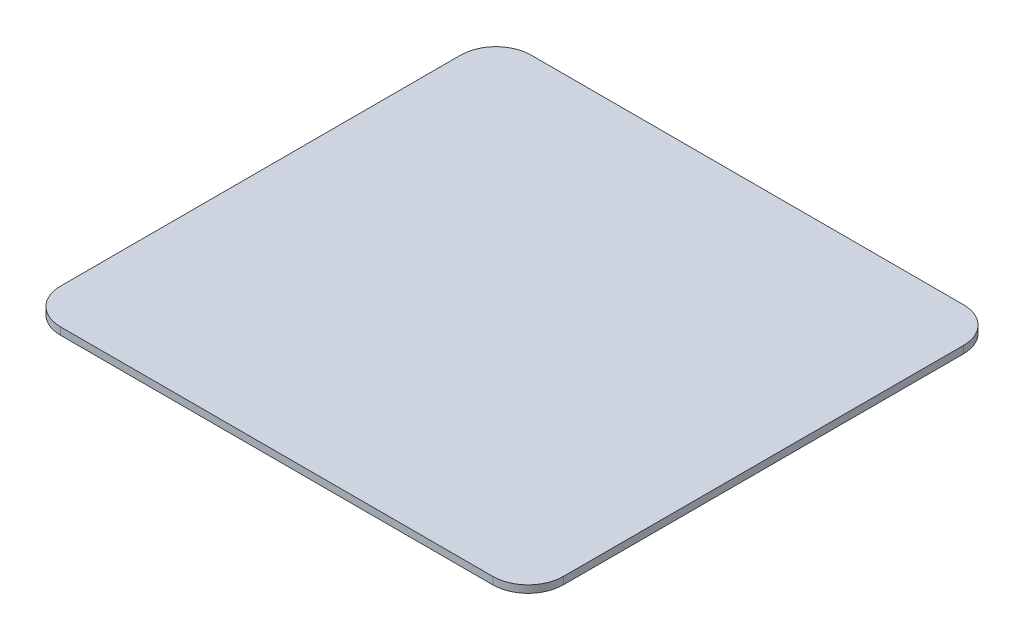
ISO-10303-21;
HEADER;
FILE_DESCRIPTION(('STEP AP214'),'2;1');
FILE_NAME('part.step','',(''),(''),'','','');
FILE_SCHEMA(('AUTOMOTIVE_DESIGN { 1 0 10303 214 1 1 1 1 }'));
ENDSEC;
DATA;
#1=APPLICATION_CONTEXT('core data for automotive mechanical design processes');
#2=APPLICATION_PROTOCOL_DEFINITION('international standard','automotive_design',2000,#1);
#3=PRODUCT_CONTEXT('',#1,'mechanical');
#4=PRODUCT('Part','Part','',(#3));
#5=PRODUCT_RELATED_PRODUCT_CATEGORY('part','',(#4));
#6=PRODUCT_DEFINITION_FORMATION('','',#4);
#7=PRODUCT_DEFINITION_CONTEXT('part definition',#1,'design');
#8=PRODUCT_DEFINITION('design','',#6,#7);
#9=PRODUCT_DEFINITION_SHAPE('','',#8);
#10=(LENGTH_UNIT() NAMED_UNIT(*) SI_UNIT(.MILLI.,.METRE.));
#11=(NAMED_UNIT(*) PLANE_ANGLE_UNIT() SI_UNIT($,.RADIAN.));
#12=(NAMED_UNIT(*) SI_UNIT($,.STERADIAN.) SOLID_ANGLE_UNIT());
#13=UNCERTAINTY_MEASURE_WITH_UNIT(LENGTH_MEASURE(1.E-05),#10,'distance_accuracy_value','');
#14=(GEOMETRIC_REPRESENTATION_CONTEXT(3) GLOBAL_UNCERTAINTY_ASSIGNED_CONTEXT((#13)) GLOBAL_UNIT_ASSIGNED_CONTEXT((#10,
#11,#12)) REPRESENTATION_CONTEXT('',''));
#15=CARTESIAN_POINT('',(0.,0.,0.));
#16=DIRECTION('',(0.,0.,1.));
#17=DIRECTION('',(1.,0.,0.));
#18=AXIS2_PLACEMENT_3D('',#15,#16,#17);
#19=CARTESIAN_POINT('',(0.,-1.5875,0.));
#20=DIRECTION('',(0.,1.,0.));
#21=DIRECTION('',(0.,0.,1.));
#22=AXIS2_PLACEMENT_3D('',#19,#20,#21);
#23=PLANE('',#22);
#24=DIRECTION('',(0.,0.,-1.));
#25=VECTOR('',#24,1.);
#26=CARTESIAN_POINT('',(-54.356,-1.5875,0.));
#27=LINE('',#26,#25);
#28=CARTESIAN_POINT('',(-54.356,-1.5875,43.2562));
#29=VERTEX_POINT('',#28);
#30=CARTESIAN_POINT('',(-54.356,-1.5875,-43.2562));
#31=VERTEX_POINT('',#30);
#32=EDGE_CURVE('E208',#29,#31,#27,.T.);
#33=ORIENTED_EDGE('',*,*,#32,.T.);
#34=CARTESIAN_POINT('',(-46.736,-1.5875,-43.2562));
#35=DIRECTION('',(0.,1.,0.));
#36=DIRECTION('',(0.,0.,1.));
#37=AXIS2_PLACEMENT_3D('',#34,#35,#36);
#38=CIRCLE('',#37,7.62);
#39=CARTESIAN_POINT('',(-46.736,-1.5875,-50.8762));
#40=VERTEX_POINT('',#39);
#41=EDGE_CURVE('E240',#31,#40,#38,.F.);
#42=ORIENTED_EDGE('',*,*,#41,.T.);
#43=DIRECTION('',(-1.,0.,0.));
#44=VECTOR('',#43,1.);
#45=CARTESIAN_POINT('',(0.,-1.5875,-50.8762));
#46=LINE('',#45,#44);
#47=CARTESIAN_POINT('',(46.736,-1.5875,-50.8762));
#48=VERTEX_POINT('',#47);
#49=EDGE_CURVE('E215',#48,#40,#46,.T.);
#50=ORIENTED_EDGE('',*,*,#49,.F.);
#51=CARTESIAN_POINT('',(46.736,-1.5875,-43.2562));
#52=DIRECTION('',(0.,1.,0.));
#53=DIRECTION('',(0.,0.,1.));
#54=AXIS2_PLACEMENT_3D('',#51,#52,#53);
#55=CIRCLE('',#54,7.62);
#56=CARTESIAN_POINT('',(54.356,-1.5875,-43.2562));
#57=VERTEX_POINT('',#56);
#58=EDGE_CURVE('E131',#48,#57,#55,.F.);
#59=ORIENTED_EDGE('',*,*,#58,.T.);
#60=DIRECTION('',(0.,0.,-1.));
#61=VECTOR('',#60,1.);
#62=CARTESIAN_POINT('',(54.356,-1.5875,0.));
#63=LINE('',#62,#61);
#64=CARTESIAN_POINT('',(54.356,-1.5875,43.2562));
#65=VERTEX_POINT('',#64);
#66=EDGE_CURVE('E263',#65,#57,#63,.T.);
#67=ORIENTED_EDGE('',*,*,#66,.F.);
#68=CARTESIAN_POINT('',(46.736,-1.5875,43.2562));
#69=DIRECTION('',(0.,1.,0.));
#70=DIRECTION('',(0.,0.,1.));
#71=AXIS2_PLACEMENT_3D('',#68,#69,#70);
#72=CIRCLE('',#71,7.62);
#73=CARTESIAN_POINT('',(46.736,-1.5875,50.8762));
#74=VERTEX_POINT('',#73);
#75=EDGE_CURVE('E235',#65,#74,#72,.F.);
#76=ORIENTED_EDGE('',*,*,#75,.T.);
#77=DIRECTION('',(-1.,0.,0.));
#78=VECTOR('',#77,1.);
#79=CARTESIAN_POINT('',(0.,-1.5875,50.8762));
#80=LINE('',#79,#78);
#81=CARTESIAN_POINT('',(-46.736,-1.5875,50.8762));
#82=VERTEX_POINT('',#81);
#83=EDGE_CURVE('E254',#74,#82,#80,.T.);
#84=ORIENTED_EDGE('',*,*,#83,.T.);
#85=CARTESIAN_POINT('',(-46.736,-1.5875,43.2562));
#86=DIRECTION('',(0.,1.,0.));
#87=DIRECTION('',(0.,0.,1.));
#88=AXIS2_PLACEMENT_3D('',#85,#86,#87);
#89=CIRCLE('',#88,7.62);
#90=EDGE_CURVE('E232',#82,#29,#89,.F.);
#91=ORIENTED_EDGE('',*,*,#90,.T.);
#92=EDGE_LOOP('',(#33,#42,#50,#59,#67,#76,#84,#91));
#93=FACE_BOUND('',#92,.T.);
#94=ADVANCED_FACE('F115',(#93),#23,.F.);
#95=CARTESIAN_POINT('',(0.,0.,0.));
#96=DIRECTION('',(0.,1.,0.));
#97=DIRECTION('',(0.,0.,1.));
#98=AXIS2_PLACEMENT_3D('',#95,#96,#97);
#99=PLANE('',#98);
#100=DIRECTION('',(-1.,0.,0.));
#101=VECTOR('',#100,1.);
#102=CARTESIAN_POINT('',(0.,0.,-50.8762));
#103=LINE('',#102,#101);
#104=CARTESIAN_POINT('',(46.736,0.,-50.8762));
#105=VERTEX_POINT('',#104);
#106=CARTESIAN_POINT('',(-46.736,0.,-50.8762));
#107=VERTEX_POINT('',#106);
#108=EDGE_CURVE('E186',#105,#107,#103,.T.);
#109=ORIENTED_EDGE('',*,*,#108,.T.);
#110=CARTESIAN_POINT('',(-46.736,0.,-43.2562));
#111=DIRECTION('',(0.,1.,0.));
#112=DIRECTION('',(0.,0.,1.));
#113=AXIS2_PLACEMENT_3D('',#110,#111,#112);
#114=CIRCLE('',#113,7.62);
#115=CARTESIAN_POINT('',(-54.356,0.,-43.2562));
#116=VERTEX_POINT('',#115);
#117=EDGE_CURVE('E193',#107,#116,#114,.T.);
#118=ORIENTED_EDGE('',*,*,#117,.T.);
#119=DIRECTION('',(0.,0.,-1.));
#120=VECTOR('',#119,1.);
#121=CARTESIAN_POINT('',(-54.356,0.,0.));
#122=LINE('',#121,#120);
#123=CARTESIAN_POINT('',(-54.356,0.,43.2562));
#124=VERTEX_POINT('',#123);
#125=EDGE_CURVE('E204',#124,#116,#122,.T.);
#126=ORIENTED_EDGE('',*,*,#125,.F.);
#127=CARTESIAN_POINT('',(-46.736,0.,43.2562));
#128=DIRECTION('',(0.,1.,0.));
#129=DIRECTION('',(0.,0.,1.));
#130=AXIS2_PLACEMENT_3D('',#127,#128,#129);
#131=CIRCLE('',#130,7.62);
#132=CARTESIAN_POINT('',(-46.736,0.,50.8762));
#133=VERTEX_POINT('',#132);
#134=EDGE_CURVE('E212',#124,#133,#131,.T.);
#135=ORIENTED_EDGE('',*,*,#134,.T.);
#136=DIRECTION('',(-1.,0.,0.));
#137=VECTOR('',#136,1.);
#138=CARTESIAN_POINT('',(0.,0.,50.8762));
#139=LINE('',#138,#137);
#140=CARTESIAN_POINT('',(46.736,0.,50.8762));
#141=VERTEX_POINT('',#140);
#142=EDGE_CURVE('E257',#141,#133,#139,.T.);
#143=ORIENTED_EDGE('',*,*,#142,.F.);
#144=CARTESIAN_POINT('',(46.736,0.,43.2562));
#145=DIRECTION('',(0.,1.,0.));
#146=DIRECTION('',(0.,0.,1.));
#147=AXIS2_PLACEMENT_3D('',#144,#145,#146);
#148=CIRCLE('',#147,7.62);
#149=CARTESIAN_POINT('',(54.356,0.,43.2562));
#150=VERTEX_POINT('',#149);
#151=EDGE_CURVE('E194',#141,#150,#148,.T.);
#152=ORIENTED_EDGE('',*,*,#151,.T.);
#153=DIRECTION('',(0.,0.,-1.));
#154=VECTOR('',#153,1.);
#155=CARTESIAN_POINT('',(54.356,0.,0.));
#156=LINE('',#155,#154);
#157=CARTESIAN_POINT('',(54.356,0.,-43.2562));
#158=VERTEX_POINT('',#157);
#159=EDGE_CURVE('E187',#150,#158,#156,.T.);
#160=ORIENTED_EDGE('',*,*,#159,.T.);
#161=CARTESIAN_POINT('',(46.736,0.,-43.2562));
#162=DIRECTION('',(0.,1.,0.));
#163=DIRECTION('',(0.,0.,1.));
#164=AXIS2_PLACEMENT_3D('',#161,#162,#163);
#165=CIRCLE('',#164,7.62);
#166=EDGE_CURVE('E183',#158,#105,#165,.T.);
#167=ORIENTED_EDGE('',*,*,#166,.T.);
#168=EDGE_LOOP('',(#109,#118,#126,#135,#143,#152,#160,#167));
#169=FACE_BOUND('',#168,.T.);
#170=ADVANCED_FACE('F185',(#169),#99,.T.);
#171=CARTESIAN_POINT('',(-54.356,-1.5875,0.));
#172=DIRECTION('',(1.,0.,0.));
#173=DIRECTION('',(0.,0.,-1.));
#174=AXIS2_PLACEMENT_3D('',#171,#172,#173);
#175=PLANE('',#174);
#176=ORIENTED_EDGE('',*,*,#125,.T.);
#177=DIRECTION('',(0.,1.,0.));
#178=VECTOR('',#177,1.);
#179=CARTESIAN_POINT('',(-54.356,-1.5875,-43.2562));
#180=LINE('',#179,#178);
#181=EDGE_CURVE('E229',#116,#31,#180,.F.);
#182=ORIENTED_EDGE('',*,*,#181,.T.);
#183=ORIENTED_EDGE('',*,*,#32,.F.);
#184=DIRECTION('',(0.,1.,0.));
#185=VECTOR('',#184,1.);
#186=CARTESIAN_POINT('',(-54.356,-1.5875,43.2562));
#187=LINE('',#186,#185);
#188=EDGE_CURVE('E225',#29,#124,#187,.T.);
#189=ORIENTED_EDGE('',*,*,#188,.T.);
#190=EDGE_LOOP('',(#176,#182,#183,#189));
#191=FACE_BOUND('',#190,.T.);
#192=ADVANCED_FACE('F269',(#191),#175,.F.);
#193=CARTESIAN_POINT('',(0.,-1.5875,-50.8762));
#194=DIRECTION('',(0.,0.,-1.));
#195=DIRECTION('',(-1.,0.,0.));
#196=AXIS2_PLACEMENT_3D('',#193,#194,#195);
#197=PLANE('',#196);
#198=ORIENTED_EDGE('',*,*,#49,.T.);
#199=DIRECTION('',(0.,1.,0.));
#200=VECTOR('',#199,1.);
#201=CARTESIAN_POINT('',(-46.736,0.,-50.8762));
#202=LINE('',#201,#200);
#203=EDGE_CURVE('E202',#40,#107,#202,.T.);
#204=ORIENTED_EDGE('',*,*,#203,.T.);
#205=ORIENTED_EDGE('',*,*,#108,.F.);
#206=DIRECTION('',(0.,1.,0.));
#207=VECTOR('',#206,1.);
#208=CARTESIAN_POINT('',(46.736,-1.5875,-50.8762));
#209=LINE('',#208,#207);
#210=EDGE_CURVE('E200',#105,#48,#209,.F.);
#211=ORIENTED_EDGE('',*,*,#210,.T.);
#212=EDGE_LOOP('',(#198,#204,#205,#211));
#213=FACE_BOUND('',#212,.T.);
#214=ADVANCED_FACE('F199',(#213),#197,.T.);
#215=CARTESIAN_POINT('',(54.356,-1.5875,0.));
#216=DIRECTION('',(1.,0.,0.));
#217=DIRECTION('',(0.,0.,-1.));
#218=AXIS2_PLACEMENT_3D('',#215,#216,#217);
#219=PLANE('',#218);
#220=ORIENTED_EDGE('',*,*,#66,.T.);
#221=DIRECTION('',(0.,1.,0.));
#222=VECTOR('',#221,1.);
#223=CARTESIAN_POINT('',(54.356,-1.5875,-43.2562));
#224=LINE('',#223,#222);
#225=EDGE_CURVE('E245',#57,#158,#224,.T.);
#226=ORIENTED_EDGE('',*,*,#225,.T.);
#227=ORIENTED_EDGE('',*,*,#159,.F.);
#228=DIRECTION('',(0.,1.,0.));
#229=VECTOR('',#228,1.);
#230=CARTESIAN_POINT('',(54.356,-1.5875,43.2562));
#231=LINE('',#230,#229);
#232=EDGE_CURVE('E138',#150,#65,#231,.F.);
#233=ORIENTED_EDGE('',*,*,#232,.T.);
#234=EDGE_LOOP('',(#220,#226,#227,#233));
#235=FACE_BOUND('',#234,.T.);
#236=ADVANCED_FACE('F280',(#235),#219,.T.);
#237=CARTESIAN_POINT('',(0.,-1.5875,50.8762));
#238=DIRECTION('',(0.,0.,-1.));
#239=DIRECTION('',(-1.,0.,0.));
#240=AXIS2_PLACEMENT_3D('',#237,#238,#239);
#241=PLANE('',#240);
#242=ORIENTED_EDGE('',*,*,#83,.F.);
#243=DIRECTION('',(0.,1.,0.));
#244=VECTOR('',#243,1.);
#245=CARTESIAN_POINT('',(46.736,0.,50.8762));
#246=LINE('',#245,#244);
#247=EDGE_CURVE('E12',#74,#141,#246,.T.);
#248=ORIENTED_EDGE('',*,*,#247,.T.);
#249=ORIENTED_EDGE('',*,*,#142,.T.);
#250=DIRECTION('',(0.,1.,0.));
#251=VECTOR('',#250,1.);
#252=CARTESIAN_POINT('',(-46.736,-1.5875,50.8762));
#253=LINE('',#252,#251);
#254=EDGE_CURVE('E124',#133,#82,#253,.F.);
#255=ORIENTED_EDGE('',*,*,#254,.T.);
#256=EDGE_LOOP('',(#242,#248,#249,#255));
#257=FACE_BOUND('',#256,.T.);
#258=ADVANCED_FACE('F253',(#257),#241,.F.);
#259=CARTESIAN_POINT('',(-46.736,-1.5875,-43.2562));
#260=DIRECTION('',(0.,-1.,0.));
#261=DIRECTION('',(0.,0.,-1.));
#262=AXIS2_PLACEMENT_3D('',#259,#260,#261);
#263=CYLINDRICAL_SURFACE('',#262,7.62);
#264=ORIENTED_EDGE('',*,*,#41,.F.);
#265=ORIENTED_EDGE('',*,*,#181,.F.);
#266=ORIENTED_EDGE('',*,*,#117,.F.);
#267=ORIENTED_EDGE('',*,*,#203,.F.);
#268=EDGE_LOOP('',(#264,#265,#266,#267));
#269=FACE_BOUND('',#268,.T.);
#270=ADVANCED_FACE('F288',(#269),#263,.T.);
#271=CARTESIAN_POINT('',(46.736,-1.5875,-43.2562));
#272=DIRECTION('',(0.,1.,0.));
#273=DIRECTION('',(0.,0.,1.));
#274=AXIS2_PLACEMENT_3D('',#271,#272,#273);
#275=CYLINDRICAL_SURFACE('',#274,7.62);
#276=ORIENTED_EDGE('',*,*,#58,.F.);
#277=ORIENTED_EDGE('',*,*,#210,.F.);
#278=ORIENTED_EDGE('',*,*,#166,.F.);
#279=ORIENTED_EDGE('',*,*,#225,.F.);
#280=EDGE_LOOP('',(#276,#277,#278,#279));
#281=FACE_BOUND('',#280,.T.);
#282=ADVANCED_FACE('F206',(#281),#275,.T.);
#283=CARTESIAN_POINT('',(46.736,-1.5875,43.2562));
#284=DIRECTION('',(0.,-1.,0.));
#285=DIRECTION('',(0.,0.,-1.));
#286=AXIS2_PLACEMENT_3D('',#283,#284,#285);
#287=CYLINDRICAL_SURFACE('',#286,7.62);
#288=ORIENTED_EDGE('',*,*,#75,.F.);
#289=ORIENTED_EDGE('',*,*,#232,.F.);
#290=ORIENTED_EDGE('',*,*,#151,.F.);
#291=ORIENTED_EDGE('',*,*,#247,.F.);
#292=EDGE_LOOP('',(#288,#289,#290,#291));
#293=FACE_BOUND('',#292,.T.);
#294=ADVANCED_FACE('F282',(#293),#287,.T.);
#295=CARTESIAN_POINT('',(-46.736,-1.5875,43.2562));
#296=DIRECTION('',(0.,1.,0.));
#297=DIRECTION('',(0.,0.,1.));
#298=AXIS2_PLACEMENT_3D('',#295,#296,#297);
#299=CYLINDRICAL_SURFACE('',#298,7.62);
#300=ORIENTED_EDGE('',*,*,#90,.F.);
#301=ORIENTED_EDGE('',*,*,#254,.F.);
#302=ORIENTED_EDGE('',*,*,#134,.F.);
#303=ORIENTED_EDGE('',*,*,#188,.F.);
#304=EDGE_LOOP('',(#300,#301,#302,#303));
#305=FACE_BOUND('',#304,.T.);
#306=ADVANCED_FACE('F117',(#305),#299,.T.);
#307=CLOSED_SHELL('',(#94,#170,#192,#214,#236,#258,#270,#282,#294,#306));
#308=MANIFOLD_SOLID_BREP('B2',#307);
#309=ADVANCED_BREP_SHAPE_REPRESENTATION('',(#18,#308),#14);
#310=SHAPE_DEFINITION_REPRESENTATION(#9,#309);
ENDSEC;
END-ISO-10303-21;
